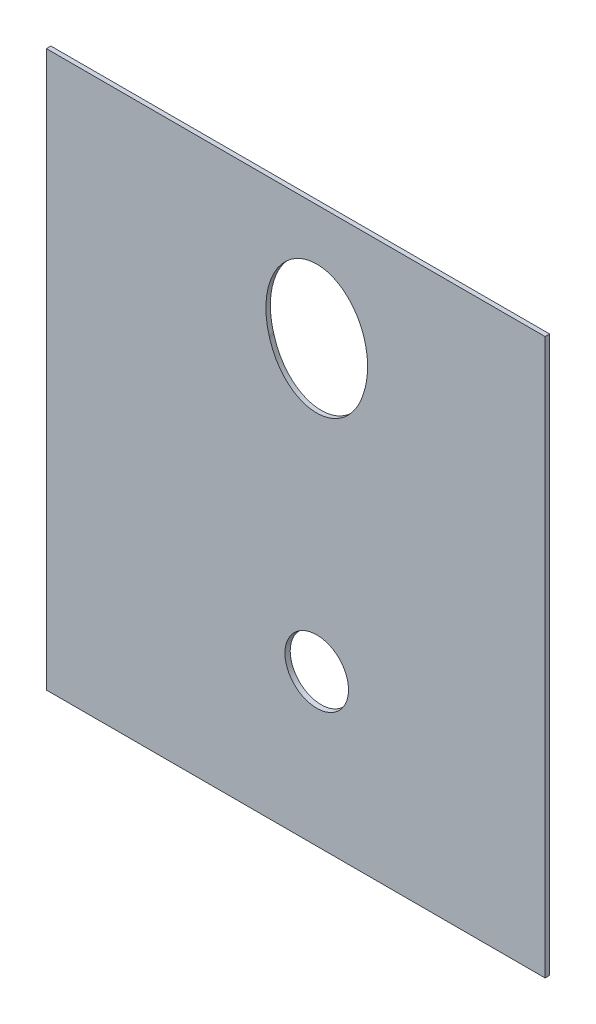
ISO-10303-21;
HEADER;
FILE_DESCRIPTION(('STEP AP214'),'2;1');
FILE_NAME('part.step','',(''),(''),'','','');
FILE_SCHEMA(('AUTOMOTIVE_DESIGN { 1 0 10303 214 1 1 1 1 }'));
ENDSEC;
DATA;
#1=APPLICATION_CONTEXT('core data for automotive mechanical design processes');
#2=APPLICATION_PROTOCOL_DEFINITION('international standard','automotive_design',2000,#1);
#3=PRODUCT_CONTEXT('',#1,'mechanical');
#4=PRODUCT('Part','Part','',(#3));
#5=PRODUCT_RELATED_PRODUCT_CATEGORY('part','',(#4));
#6=PRODUCT_DEFINITION_FORMATION('','',#4);
#7=PRODUCT_DEFINITION_CONTEXT('part definition',#1,'design');
#8=PRODUCT_DEFINITION('design','',#6,#7);
#9=PRODUCT_DEFINITION_SHAPE('','',#8);
#10=(LENGTH_UNIT() NAMED_UNIT(*) SI_UNIT(.MILLI.,.METRE.));
#11=(NAMED_UNIT(*) PLANE_ANGLE_UNIT() SI_UNIT($,.RADIAN.));
#12=(NAMED_UNIT(*) SI_UNIT($,.STERADIAN.) SOLID_ANGLE_UNIT());
#13=UNCERTAINTY_MEASURE_WITH_UNIT(LENGTH_MEASURE(1.E-05),#10,'distance_accuracy_value','');
#14=(GEOMETRIC_REPRESENTATION_CONTEXT(3) GLOBAL_UNCERTAINTY_ASSIGNED_CONTEXT((#13)) GLOBAL_UNIT_ASSIGNED_CONTEXT((#10,
#11,#12)) REPRESENTATION_CONTEXT('',''));
#15=CARTESIAN_POINT('',(0.,0.,0.));
#16=DIRECTION('',(0.,0.,1.));
#17=DIRECTION('',(1.,0.,0.));
#18=AXIS2_PLACEMENT_3D('',#15,#16,#17);
#19=CARTESIAN_POINT('',(36.,43.9110671250358,18.3200929143861));
#20=DIRECTION('',(0.,0.587785252292475,-0.809016994374946));
#21=DIRECTION('',(1.,0.,0.));
#22=AXIS2_PLACEMENT_3D('',#19,#20,#21);
#23=CONICAL_SURFACE('',#22,2.81683710503338,0.165578784914986);
#24=CARTESIAN_POINT('',(29.6941685997879,55.5965221943459,-0.600000000043305));
#25=CARTESIAN_POINT('',(29.7113824553914,55.532505432148,-0.408737631704855));
#26=CARTESIAN_POINT('',(29.7293013456821,55.4685089721892,-0.21753591284495));
#27=CARTESIAN_POINT('',(29.748782548073,55.4015879295947,-0.0175964338019082));
#28=CARTESIAN_POINT('',(29.7496413193491,55.3986430877372,-0.00879815264741068));
#29=CARTESIAN_POINT('',(29.7505015844883,55.3956982888971,0.));
#30=B_SPLINE_CURVE_WITH_KNOTS('',3,(#24,#25,#26,#27,#28,#29),.UNSPECIFIED.,.F.,.F.,(4,2,4),(0.,
0.607266479647421,0.635219547394912),.UNSPECIFIED.);
#31=CARTESIAN_POINT('',(29.6941685997879,55.5965221943459,-0.600000000000104));
#32=VERTEX_POINT('',#31);
#33=CARTESIAN_POINT('',(29.7505015844883,55.3956982888971,0.));
#34=VERTEX_POINT('',#33);
#35=EDGE_CURVE('E13',#32,#34,#30,.T.);
#36=ORIENTED_EDGE('',*,*,#35,.F.);
#37=CARTESIAN_POINT('',(36.,58.6816490951203,-0.600000000000125));
#38=DIRECTION('',(0.,0.,1.));
#39=DIRECTION('',(0.,1.,0.));
#40=AXIS2_PLACEMENT_3D('',#37,#38,#39);
#41=ELLIPSE('',#40,8.43683551041977,6.77504961883544);
#42=CARTESIAN_POINT('',(29.6331663146411,55.7973460997656,-0.600000000000111));
#43=VERTEX_POINT('',#42);
#44=EDGE_CURVE('E210',#32,#43,#41,.F.);
#45=ORIENTED_EDGE('',*,*,#44,.T.);
#46=CARTESIAN_POINT('',(29.6941685997918,55.5965221943315,-1.07552855510562E-13));
#47=CARTESIAN_POINT('',(29.6739995780012,55.6604700367616,-0.191056464999153));
#48=CARTESIAN_POINT('',(29.6545353064069,55.7244390693559,-0.382176239677642));
#49=CARTESIAN_POINT('',(29.6349044411075,55.7914015156153,-0.582239412771068));
#50=CARTESIAN_POINT('',(29.6340346176515,55.7943737848324,-0.591119638092439));
#51=CARTESIAN_POINT('',(29.6331663146411,55.7973460997656,-0.599999999999688));
#52=B_SPLINE_CURVE_WITH_KNOTS('',3,(#46,#47,#48,#49,#50,#51),.UNSPECIFIED.,.F.,.F.,(4,2,4),(0.,
0.607436391284005,0.635650650269757),.UNSPECIFIED.);
#53=CARTESIAN_POINT('',(29.6941685997876,55.5965221943458,-1.11022302462516E-13));
#54=VERTEX_POINT('',#53);
#55=EDGE_CURVE('E189',#54,#43,#52,.T.);
#56=ORIENTED_EDGE('',*,*,#55,.F.);
#57=CARTESIAN_POINT('',(36.,58.2268460603197,-1.17961196366423E-13));
#58=DIRECTION('',(0.,0.,1.));
#59=DIRECTION('',(0.,1.,0.));
#60=AXIS2_PLACEMENT_3D('',#57,#58,#59);
#61=ELLIPSE('',#60,8.28135188697452,6.65019128036755);
#62=EDGE_CURVE('E107',#34,#54,#61,.F.);
#63=ORIENTED_EDGE('',*,*,#62,.F.);
#64=EDGE_LOOP('',(#36,#45,#56,#63));
#65=FACE_BOUND('',#64,.T.);
#66=ADVANCED_FACE('F59',(#65),#23,.F.);
#67=CARTESIAN_POINT('',(0.,66.0063365229148,-0.600000000000166));
#68=DIRECTION('',(0.,0.,1.));
#69=DIRECTION('',(0.,-1.,0.));
#70=AXIS2_PLACEMENT_3D('',#67,#68,#69);
#71=PLANE('',#70);
#72=DIRECTION('',(0.,-1.,0.));
#73=VECTOR('',#72,1.);
#74=CARTESIAN_POINT('',(66.4117370824268,66.0063365229148,-0.600000000000166));
#75=LINE('',#74,#73);
#76=CARTESIAN_POINT('',(66.4117370824268,73.9638923297336,-0.600000000000222));
#77=VERTEX_POINT('',#76);
#78=CARTESIAN_POINT('',(66.4117370824268,0.,-0.6));
#79=VERTEX_POINT('',#78);
#80=EDGE_CURVE('E157',#77,#79,#75,.T.);
#81=ORIENTED_EDGE('',*,*,#80,.T.);
#82=DIRECTION('',(1.,0.,0.));
#83=VECTOR('',#82,1.);
#84=CARTESIAN_POINT('',(0.,0.,-0.6));
#85=LINE('',#84,#83);
#86=CARTESIAN_POINT('',(0.,0.,-0.6));
#87=VERTEX_POINT('',#86);
#88=EDGE_CURVE('E149',#87,#79,#85,.T.);
#89=ORIENTED_EDGE('',*,*,#88,.F.);
#90=DIRECTION('',(0.,1.,0.));
#91=VECTOR('',#90,1.);
#92=CARTESIAN_POINT('',(0.,66.0063365229148,-0.600000000000166));
#93=LINE('',#92,#91);
#94=CARTESIAN_POINT('',(0.,73.9638923297336,-0.600000000000222));
#95=VERTEX_POINT('',#94);
#96=EDGE_CURVE('E136',#87,#95,#93,.T.);
#97=ORIENTED_EDGE('',*,*,#96,.T.);
#98=DIRECTION('',(1.,0.,0.));
#99=VECTOR('',#98,1.);
#100=CARTESIAN_POINT('',(0.,73.9638923297336,-0.600000000000222));
#101=LINE('',#100,#99);
#102=EDGE_CURVE('E85',#95,#77,#101,.T.);
#103=ORIENTED_EDGE('',*,*,#102,.T.);
#104=EDGE_LOOP('',(#81,#89,#97,#103));
#105=FACE_BOUND('',#104,.T.);
#106=ORIENTED_EDGE('',*,*,#44,.F.);
#107=CARTESIAN_POINT('',(36.,58.2268460603197,-0.600000000000125));
#108=DIRECTION('',(0.,0.,1.));
#109=DIRECTION('',(0.,1.,0.));
#110=AXIS2_PLACEMENT_3D('',#107,#108,#109);
#111=ELLIPSE('',#110,8.28135188697452,6.65019128036755);
#112=CARTESIAN_POINT('',(42.305831400212,55.5965221943459,-0.600000000000104));
#113=VERTEX_POINT('',#112);
#114=EDGE_CURVE('E152',#32,#113,#111,.T.);
#115=ORIENTED_EDGE('',*,*,#114,.T.);
#116=CARTESIAN_POINT('',(42.366833685359,55.7973460997659,-0.600000000000111));
#117=VERTEX_POINT('',#116);
#118=EDGE_CURVE('E222',#117,#113,#41,.F.);
#119=ORIENTED_EDGE('',*,*,#118,.F.);
#120=EDGE_CURVE('E214',#43,#117,#41,.F.);
#121=ORIENTED_EDGE('',*,*,#120,.F.);
#122=EDGE_LOOP('',(#106,#115,#119,#121));
#123=FACE_BOUND('',#122,.T.);
#124=CARTESIAN_POINT('',(36.,20.13458531313,-0.6));
#125=DIRECTION('',(0.,0.,-1.));
#126=DIRECTION('',(-1.,0.,0.));
#127=AXIS2_PLACEMENT_3D('',#124,#125,#126);
#128=CIRCLE('',#127,4.13245990112886);
#129=CARTESIAN_POINT('',(31.8675400988711,20.13458531313,-0.6));
#130=VERTEX_POINT('',#129);
#131=EDGE_CURVE('E162',#130,#130,#128,.F.);
#132=ORIENTED_EDGE('',*,*,#131,.T.);
#133=EDGE_LOOP('',(#132));
#134=FACE_BOUND('',#133,.T.);
#135=ADVANCED_FACE('F154',(#105,#123,#134),#71,.F.);
#136=CARTESIAN_POINT('',(0.,0.,0.));
#137=DIRECTION('',(0.,0.,-1.));
#138=DIRECTION('',(-1.,0.,0.));
#139=AXIS2_PLACEMENT_3D('',#136,#137,#138);
#140=PLANE('',#139);
#141=CARTESIAN_POINT('',(36.,58.6816490951203,-1.28369537222284E-13));
#142=DIRECTION('',(0.,0.,-1.));
#143=DIRECTION('',(0.,1.,0.));
#144=AXIS2_PLACEMENT_3D('',#141,#142,#143);
#145=ELLIPSE('',#144,8.43683551041977,6.77504961883544);
#146=CARTESIAN_POINT('',(42.3058314002124,55.5965221943458,-1.11022302462516E-13));
#147=VERTEX_POINT('',#146);
#148=EDGE_CURVE('E171',#54,#147,#145,.T.);
#149=ORIENTED_EDGE('',*,*,#148,.T.);
#150=CARTESIAN_POINT('',(42.2494984155117,55.3956982888971,-1.04083408558608E-13));
#151=VERTEX_POINT('',#150);
#152=EDGE_CURVE('E207',#147,#151,#61,.F.);
#153=ORIENTED_EDGE('',*,*,#152,.T.);
#154=EDGE_CURVE('E211',#151,#34,#61,.F.);
#155=ORIENTED_EDGE('',*,*,#154,.T.);
#156=ORIENTED_EDGE('',*,*,#62,.T.);
#157=EDGE_LOOP('',(#149,#153,#155,#156));
#158=FACE_BOUND('',#157,.T.);
#159=DIRECTION('',(0.,-1.,0.));
#160=VECTOR('',#159,1.);
#161=CARTESIAN_POINT('',(0.,73.9638923297336,-2.25514051876985E-13));
#162=LINE('',#161,#160);
#163=CARTESIAN_POINT('',(0.,0.,0.));
#164=VERTEX_POINT('',#163);
#165=CARTESIAN_POINT('',(0.,73.9638923297336,-2.25514051876985E-13));
#166=VERTEX_POINT('',#165);
#167=EDGE_CURVE('E100',#164,#166,#162,.F.);
#168=ORIENTED_EDGE('',*,*,#167,.F.);
#169=DIRECTION('',(1.,0.,0.));
#170=VECTOR('',#169,1.);
#171=CARTESIAN_POINT('',(0.,0.,0.));
#172=LINE('',#171,#170);
#173=CARTESIAN_POINT('',(66.4117370824268,0.,0.));
#174=VERTEX_POINT('',#173);
#175=EDGE_CURVE('E151',#164,#174,#172,.T.);
#176=ORIENTED_EDGE('',*,*,#175,.T.);
#177=DIRECTION('',(0.,1.,0.));
#178=VECTOR('',#177,1.);
#179=CARTESIAN_POINT('',(66.4117370824268,33.1105024520387,0.));
#180=LINE('',#179,#178);
#181=CARTESIAN_POINT('',(66.4117370824268,73.9638923297336,-2.25514051876985E-13));
#182=VERTEX_POINT('',#181);
#183=EDGE_CURVE('E143',#182,#174,#180,.F.);
#184=ORIENTED_EDGE('',*,*,#183,.F.);
#185=DIRECTION('',(-1.,0.,0.));
#186=VECTOR('',#185,1.);
#187=CARTESIAN_POINT('',(66.4117370824268,73.9638923297336,-2.25514051876985E-13));
#188=LINE('',#187,#186);
#189=EDGE_CURVE('E213',#166,#182,#188,.F.);
#190=ORIENTED_EDGE('',*,*,#189,.F.);
#191=EDGE_LOOP('',(#168,#176,#184,#190));
#192=FACE_BOUND('',#191,.T.);
#193=CARTESIAN_POINT('',(36.,20.13458531313,0.));
#194=DIRECTION('',(0.,0.,-1.));
#195=DIRECTION('',(-1.,0.,0.));
#196=AXIS2_PLACEMENT_3D('',#193,#194,#195);
#197=CIRCLE('',#196,4.23272515311825);
#198=CARTESIAN_POINT('',(31.7672748468817,20.13458531313,0.));
#199=VERTEX_POINT('',#198);
#200=EDGE_CURVE('E160',#199,#199,#197,.F.);
#201=ORIENTED_EDGE('',*,*,#200,.F.);
#202=EDGE_LOOP('',(#201));
#203=FACE_BOUND('',#202,.T.);
#204=ADVANCED_FACE('F61',(#158,#192,#203),#140,.F.);
#205=CARTESIAN_POINT('',(0.,73.9638923297336,-0.600000000000218));
#206=DIRECTION('',(1.,0.,0.));
#207=DIRECTION('',(0.,-0.587785252292475,0.809016994374946));
#208=AXIS2_PLACEMENT_3D('',#205,#206,#207);
#209=PLANE('',#208);
#210=ORIENTED_EDGE('',*,*,#96,.F.);
#211=DIRECTION('',(0.,0.,1.));
#212=VECTOR('',#211,1.);
#213=CARTESIAN_POINT('',(0.,0.,-0.6));
#214=LINE('',#213,#212);
#215=EDGE_CURVE('E139',#87,#164,#214,.T.);
#216=ORIENTED_EDGE('',*,*,#215,.T.);
#217=ORIENTED_EDGE('',*,*,#167,.T.);
#218=DIRECTION('',(0.,0.,1.));
#219=VECTOR('',#218,1.);
#220=CARTESIAN_POINT('',(0.,73.9638923297336,-0.600000000000218));
#221=LINE('',#220,#219);
#222=EDGE_CURVE('E141',#95,#166,#221,.T.);
#223=ORIENTED_EDGE('',*,*,#222,.F.);
#224=EDGE_LOOP('',(#210,#216,#217,#223));
#225=FACE_BOUND('',#224,.T.);
#226=ADVANCED_FACE('F138',(#225),#209,.F.);
#227=CARTESIAN_POINT('',(66.4117370824268,33.1105024520387,-0.599999999999934));
#228=DIRECTION('',(-1.,0.,0.));
#229=DIRECTION('',(0.,0.587785252292475,-0.809016994374946));
#230=AXIS2_PLACEMENT_3D('',#227,#228,#229);
#231=PLANE('',#230);
#232=ORIENTED_EDGE('',*,*,#183,.T.);
#233=DIRECTION('',(0.,0.,1.));
#234=VECTOR('',#233,1.);
#235=CARTESIAN_POINT('',(66.4117370824268,0.,-0.6));
#236=LINE('',#235,#234);
#237=EDGE_CURVE('E159',#79,#174,#236,.T.);
#238=ORIENTED_EDGE('',*,*,#237,.F.);
#239=ORIENTED_EDGE('',*,*,#80,.F.);
#240=DIRECTION('',(0.,0.,1.));
#241=VECTOR('',#240,1.);
#242=CARTESIAN_POINT('',(66.4117370824268,73.9638923297336,-0.600000000000215));
#243=LINE('',#242,#241);
#244=EDGE_CURVE('E219',#77,#182,#243,.T.);
#245=ORIENTED_EDGE('',*,*,#244,.T.);
#246=EDGE_LOOP('',(#232,#238,#239,#245));
#247=FACE_BOUND('',#246,.T.);
#248=ADVANCED_FACE('F245',(#247),#231,.F.);
#249=CARTESIAN_POINT('',(66.4117370824268,73.9638923297336,-0.600000000000218));
#250=DIRECTION('',(0.,-1.,0.));
#251=DIRECTION('',(0.,0.,-1.));
#252=AXIS2_PLACEMENT_3D('',#249,#250,#251);
#253=PLANE('',#252);
#254=ORIENTED_EDGE('',*,*,#189,.T.);
#255=ORIENTED_EDGE('',*,*,#244,.F.);
#256=ORIENTED_EDGE('',*,*,#102,.F.);
#257=ORIENTED_EDGE('',*,*,#222,.T.);
#258=EDGE_LOOP('',(#254,#255,#256,#257));
#259=FACE_BOUND('',#258,.T.);
#260=ADVANCED_FACE('F243',(#259),#253,.F.);
#261=CARTESIAN_POINT('',(42.305831400212,55.5965221943459,-0.600000000042941));
#262=CARTESIAN_POINT('',(42.2886175446032,55.5325054321478,-0.408737631705197));
#263=CARTESIAN_POINT('',(42.2706986543123,55.468508972189,-0.217535912845438));
#264=CARTESIAN_POINT('',(42.2512174519265,55.4015879295947,-0.0175964338019568));
#265=CARTESIAN_POINT('',(42.2503586806507,55.3986430877372,-0.00879815264743384));
#266=CARTESIAN_POINT('',(42.2494984155117,55.3956982888971,0.));
#267=B_SPLINE_CURVE_WITH_KNOTS('',3,(#261,#262,#263,#264,#265,#266),.UNSPECIFIED.,.F.,.F.,(4,2,
4),(0.,0.607266479647077,0.635219547394569),.UNSPECIFIED.);
#268=EDGE_CURVE('E71',#151,#113,#267,.F.);
#269=ORIENTED_EDGE('',*,*,#268,.F.);
#270=ORIENTED_EDGE('',*,*,#152,.F.);
#271=CARTESIAN_POINT('',(42.3058314002082,55.5965221943315,-1.07552855510562E-13));
#272=CARTESIAN_POINT('',(42.3260004219986,55.6604700367611,-0.191056464999506));
#273=CARTESIAN_POINT('',(42.3454646935929,55.7244390693555,-0.382176239678143));
#274=CARTESIAN_POINT('',(42.3650955588926,55.7914015156155,-0.582239412771506));
#275=CARTESIAN_POINT('',(42.3659653823486,55.7943737848326,-0.59111963809287));
#276=CARTESIAN_POINT('',(42.366833685359,55.7973460997659,-0.600000000000111));
#277=B_SPLINE_CURVE_WITH_KNOTS('',3,(#271,#272,#273,#274,#275,#276),.UNSPECIFIED.,.F.,.F.,(4,2,
4),(0.,0.607436391284481,0.635650650270243),.UNSPECIFIED.);
#278=EDGE_CURVE('E114',#117,#147,#277,.F.);
#279=ORIENTED_EDGE('',*,*,#278,.F.);
#280=ORIENTED_EDGE('',*,*,#118,.T.);
#281=EDGE_LOOP('',(#269,#270,#279,#280));
#282=FACE_BOUND('',#281,.T.);
#283=ADVANCED_FACE('F198',(#282),#23,.F.);
#284=DIRECTION('',(0.,0.,-1.));
#285=VECTOR('',#284,1.);
#286=SURFACE_OF_LINEAR_EXTRUSION('',#145,#285);
#287=ORIENTED_EDGE('',*,*,#55,.T.);
#288=ORIENTED_EDGE('',*,*,#120,.T.);
#289=ORIENTED_EDGE('',*,*,#278,.T.);
#290=ORIENTED_EDGE('',*,*,#148,.F.);
#291=EDGE_LOOP('',(#287,#288,#289,#290));
#292=FACE_BOUND('',#291,.T.);
#293=ADVANCED_FACE('F180',(#292),#286,.F.);
#294=DIRECTION('',(0.,0.,1.));
#295=VECTOR('',#294,1.);
#296=SURFACE_OF_LINEAR_EXTRUSION('',#111,#295);
#297=ORIENTED_EDGE('',*,*,#35,.T.);
#298=ORIENTED_EDGE('',*,*,#154,.F.);
#299=ORIENTED_EDGE('',*,*,#268,.T.);
#300=ORIENTED_EDGE('',*,*,#114,.F.);
#301=EDGE_LOOP('',(#297,#298,#299,#300));
#302=FACE_BOUND('',#301,.T.);
#303=ADVANCED_FACE('F174',(#302),#296,.F.);
#304=CARTESIAN_POINT('',(36.,20.13458531313,-8.47285387504757));
#305=DIRECTION('',(0.,0.,1.));
#306=DIRECTION('',(1.,0.,0.));
#307=AXIS2_PLACEMENT_3D('',#304,#305,#306);
#308=CONICAL_SURFACE('',#307,2.81683710503338,0.165578784914986);
#309=ORIENTED_EDGE('',*,*,#131,.F.);
#310=EDGE_LOOP('',(#309));
#311=FACE_BOUND('',#310,.T.);
#312=ORIENTED_EDGE('',*,*,#200,.T.);
#313=EDGE_LOOP('',(#312));
#314=FACE_BOUND('',#313,.T.);
#315=ADVANCED_FACE('F179',(#311,#314),#308,.F.);
#316=CARTESIAN_POINT('',(0.,0.,-0.6));
#317=DIRECTION('',(0.,-1.,0.));
#318=DIRECTION('',(0.,0.,-1.));
#319=AXIS2_PLACEMENT_3D('',#316,#317,#318);
#320=PLANE('',#319);
#321=ORIENTED_EDGE('',*,*,#175,.F.);
#322=ORIENTED_EDGE('',*,*,#215,.F.);
#323=ORIENTED_EDGE('',*,*,#88,.T.);
#324=ORIENTED_EDGE('',*,*,#237,.T.);
#325=EDGE_LOOP('',(#321,#322,#323,#324));
#326=FACE_BOUND('',#325,.T.);
#327=ADVANCED_FACE('F147',(#326),#320,.T.);
#328=CLOSED_SHELL('',(#66,#135,#204,#226,#248,#260,#283,#293,#303,#315,#327));
#329=MANIFOLD_SOLID_BREP('B2',#328);
#330=ADVANCED_BREP_SHAPE_REPRESENTATION('',(#18,#329),#14);
#331=SHAPE_DEFINITION_REPRESENTATION(#9,#330);
ENDSEC;
END-ISO-10303-21;
